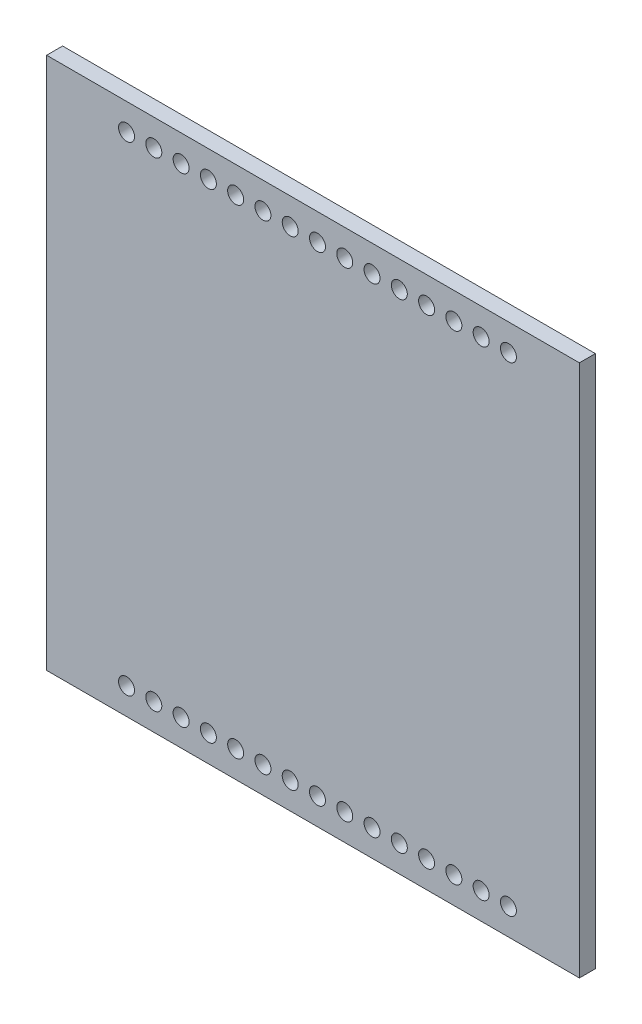
ISO-10303-21;
HEADER;
FILE_DESCRIPTION(('STEP AP214'),'2;1');
FILE_NAME('part.step','',(''),(''),'','','');
FILE_SCHEMA(('AUTOMOTIVE_DESIGN { 1 0 10303 214 1 1 1 1 }'));
ENDSEC;
DATA;
#1=APPLICATION_CONTEXT('core data for automotive mechanical design processes');
#2=APPLICATION_PROTOCOL_DEFINITION('international standard','automotive_design',2000,#1);
#3=PRODUCT_CONTEXT('',#1,'mechanical');
#4=PRODUCT('Part','Part','',(#3));
#5=PRODUCT_RELATED_PRODUCT_CATEGORY('part','',(#4));
#6=PRODUCT_DEFINITION_FORMATION('','',#4);
#7=PRODUCT_DEFINITION_CONTEXT('part definition',#1,'design');
#8=PRODUCT_DEFINITION('design','',#6,#7);
#9=PRODUCT_DEFINITION_SHAPE('','',#8);
#10=(LENGTH_UNIT() NAMED_UNIT(*) SI_UNIT(.MILLI.,.METRE.));
#11=(NAMED_UNIT(*) PLANE_ANGLE_UNIT() SI_UNIT($,.RADIAN.));
#12=(NAMED_UNIT(*) SI_UNIT($,.STERADIAN.) SOLID_ANGLE_UNIT());
#13=UNCERTAINTY_MEASURE_WITH_UNIT(LENGTH_MEASURE(1.E-05),#10,'distance_accuracy_value','');
#14=(GEOMETRIC_REPRESENTATION_CONTEXT(3) GLOBAL_UNCERTAINTY_ASSIGNED_CONTEXT((#13)) GLOBAL_UNIT_ASSIGNED_CONTEXT((#10,
#11,#12)) REPRESENTATION_CONTEXT('',''));
#15=CARTESIAN_POINT('',(0.,0.,0.));
#16=DIRECTION('',(0.,0.,1.));
#17=DIRECTION('',(1.,0.,0.));
#18=AXIS2_PLACEMENT_3D('',#15,#16,#17);
#19=CARTESIAN_POINT('',(-25.,-25.,1.5));
#20=DIRECTION('',(1.,0.,0.));
#21=DIRECTION('',(0.,0.,-1.));
#22=AXIS2_PLACEMENT_3D('',#19,#20,#21);
#23=PLANE('',#22);
#24=DIRECTION('',(0.,-1.,0.));
#25=VECTOR('',#24,1.);
#26=CARTESIAN_POINT('',(-25.,-25.,0.));
#27=LINE('',#26,#25);
#28=CARTESIAN_POINT('',(-25.,25.,0.));
#29=VERTEX_POINT('',#28);
#30=CARTESIAN_POINT('',(-25.,-25.,0.));
#31=VERTEX_POINT('',#30);
#32=EDGE_CURVE('E98',#29,#31,#27,.T.);
#33=ORIENTED_EDGE('',*,*,#32,.T.);
#34=DIRECTION('',(0.,0.,-1.));
#35=VECTOR('',#34,1.);
#36=CARTESIAN_POINT('',(-25.,-25.,1.5));
#37=LINE('',#36,#35);
#38=CARTESIAN_POINT('',(-25.,-25.,1.5));
#39=VERTEX_POINT('',#38);
#40=EDGE_CURVE('E11',#39,#31,#37,.T.);
#41=ORIENTED_EDGE('',*,*,#40,.F.);
#42=DIRECTION('',(0.,-1.,0.));
#43=VECTOR('',#42,1.);
#44=CARTESIAN_POINT('',(-25.,-25.,1.5));
#45=LINE('',#44,#43);
#46=CARTESIAN_POINT('',(-25.,25.,1.5));
#47=VERTEX_POINT('',#46);
#48=EDGE_CURVE('E86',#47,#39,#45,.T.);
#49=ORIENTED_EDGE('',*,*,#48,.F.);
#50=DIRECTION('',(0.,0.,-1.));
#51=VECTOR('',#50,1.);
#52=CARTESIAN_POINT('',(-25.,25.,1.5));
#53=LINE('',#52,#51);
#54=EDGE_CURVE('E94',#47,#29,#53,.T.);
#55=ORIENTED_EDGE('',*,*,#54,.T.);
#56=EDGE_LOOP('',(#33,#41,#49,#55));
#57=FACE_BOUND('',#56,.T.);
#58=ADVANCED_FACE('F35',(#57),#23,.F.);
#59=CARTESIAN_POINT('',(25.,-25.,1.5));
#60=DIRECTION('',(0.,1.,0.));
#61=DIRECTION('',(-1.,0.,0.));
#62=AXIS2_PLACEMENT_3D('',#59,#60,#61);
#63=PLANE('',#62);
#64=DIRECTION('',(1.,0.,0.));
#65=VECTOR('',#64,1.);
#66=CARTESIAN_POINT('',(25.,-25.,0.));
#67=LINE('',#66,#65);
#68=CARTESIAN_POINT('',(25.,-25.,0.));
#69=VERTEX_POINT('',#68);
#70=EDGE_CURVE('E90',#31,#69,#67,.T.);
#71=ORIENTED_EDGE('',*,*,#70,.T.);
#72=DIRECTION('',(0.,0.,-1.));
#73=VECTOR('',#72,1.);
#74=CARTESIAN_POINT('',(25.,-25.,1.5));
#75=LINE('',#74,#73);
#76=CARTESIAN_POINT('',(25.,-25.,1.5));
#77=VERTEX_POINT('',#76);
#78=EDGE_CURVE('E43',#77,#69,#75,.T.);
#79=ORIENTED_EDGE('',*,*,#78,.F.);
#80=DIRECTION('',(1.,0.,0.));
#81=VECTOR('',#80,1.);
#82=CARTESIAN_POINT('',(25.,-25.,1.5));
#83=LINE('',#82,#81);
#84=EDGE_CURVE('E81',#39,#77,#83,.T.);
#85=ORIENTED_EDGE('',*,*,#84,.F.);
#86=ORIENTED_EDGE('',*,*,#40,.T.);
#87=EDGE_LOOP('',(#71,#79,#85,#86));
#88=FACE_BOUND('',#87,.T.);
#89=ADVANCED_FACE('F89',(#88),#63,.F.);
#90=CARTESIAN_POINT('',(25.,-25.,1.5));
#91=DIRECTION('',(-1.,0.,0.));
#92=DIRECTION('',(0.,0.,1.));
#93=AXIS2_PLACEMENT_3D('',#90,#91,#92);
#94=PLANE('',#93);
#95=DIRECTION('',(0.,1.,0.));
#96=VECTOR('',#95,1.);
#97=CARTESIAN_POINT('',(25.,-25.,0.));
#98=LINE('',#97,#96);
#99=CARTESIAN_POINT('',(25.,25.,0.));
#100=VERTEX_POINT('',#99);
#101=EDGE_CURVE('E68',#69,#100,#98,.T.);
#102=ORIENTED_EDGE('',*,*,#101,.T.);
#103=DIRECTION('',(0.,0.,-1.));
#104=VECTOR('',#103,1.);
#105=CARTESIAN_POINT('',(25.,25.,1.5));
#106=LINE('',#105,#104);
#107=CARTESIAN_POINT('',(25.,25.,1.5));
#108=VERTEX_POINT('',#107);
#109=EDGE_CURVE('E91',#108,#100,#106,.T.);
#110=ORIENTED_EDGE('',*,*,#109,.F.);
#111=DIRECTION('',(0.,1.,0.));
#112=VECTOR('',#111,1.);
#113=CARTESIAN_POINT('',(25.,-25.,1.5));
#114=LINE('',#113,#112);
#115=EDGE_CURVE('E84',#77,#108,#114,.T.);
#116=ORIENTED_EDGE('',*,*,#115,.F.);
#117=ORIENTED_EDGE('',*,*,#78,.T.);
#118=EDGE_LOOP('',(#102,#110,#116,#117));
#119=FACE_BOUND('',#118,.T.);
#120=ADVANCED_FACE('F92',(#119),#94,.F.);
#121=CARTESIAN_POINT('',(25.,25.,1.5));
#122=DIRECTION('',(0.,-1.,0.));
#123=DIRECTION('',(1.,0.,0.));
#124=AXIS2_PLACEMENT_3D('',#121,#122,#123);
#125=PLANE('',#124);
#126=DIRECTION('',(-1.,0.,0.));
#127=VECTOR('',#126,1.);
#128=CARTESIAN_POINT('',(25.,25.,0.));
#129=LINE('',#128,#127);
#130=EDGE_CURVE('E74',#100,#29,#129,.T.);
#131=ORIENTED_EDGE('',*,*,#130,.T.);
#132=ORIENTED_EDGE('',*,*,#54,.F.);
#133=DIRECTION('',(-1.,0.,0.));
#134=VECTOR('',#133,1.);
#135=CARTESIAN_POINT('',(25.,25.,1.5));
#136=LINE('',#135,#134);
#137=EDGE_CURVE('E51',#108,#47,#136,.T.);
#138=ORIENTED_EDGE('',*,*,#137,.F.);
#139=ORIENTED_EDGE('',*,*,#109,.T.);
#140=EDGE_LOOP('',(#131,#132,#138,#139));
#141=FACE_BOUND('',#140,.T.);
#142=ADVANCED_FACE('F106',(#141),#125,.F.);
#143=CARTESIAN_POINT('',(0.,0.,1.5));
#144=DIRECTION('',(0.,0.,1.));
#145=DIRECTION('',(1.,0.,0.));
#146=AXIS2_PLACEMENT_3D('',#143,#144,#145);
#147=PLANE('',#146);
#148=CARTESIAN_POINT('',(-14.94,-22.5,1.5));
#149=DIRECTION('',(0.,0.,1.));
#150=DIRECTION('',(1.,0.,0.));
#151=AXIS2_PLACEMENT_3D('',#148,#149,#150);
#152=CIRCLE('',#151,0.75);
#153=CARTESIAN_POINT('',(-14.19,-22.5,1.5));
#154=VERTEX_POINT('',#153);
#155=EDGE_CURVE('E286',#154,#154,#152,.T.);
#156=ORIENTED_EDGE('',*,*,#155,.F.);
#157=EDGE_LOOP('',(#156));
#158=FACE_BOUND('',#157,.T.);
#159=CARTESIAN_POINT('',(-12.38,-22.5,1.5));
#160=DIRECTION('',(0.,0.,1.));
#161=DIRECTION('',(1.,0.,0.));
#162=AXIS2_PLACEMENT_3D('',#159,#160,#161);
#163=CIRCLE('',#162,0.75);
#164=CARTESIAN_POINT('',(-11.63,-22.5,1.5));
#165=VERTEX_POINT('',#164);
#166=EDGE_CURVE('E280',#165,#165,#163,.T.);
#167=ORIENTED_EDGE('',*,*,#166,.F.);
#168=EDGE_LOOP('',(#167));
#169=FACE_BOUND('',#168,.T.);
#170=CARTESIAN_POINT('',(-9.81999999999999,-22.5,1.5));
#171=DIRECTION('',(0.,0.,1.));
#172=DIRECTION('',(1.,0.,0.));
#173=AXIS2_PLACEMENT_3D('',#170,#171,#172);
#174=CIRCLE('',#173,0.75);
#175=CARTESIAN_POINT('',(-9.06999999999999,-22.5,1.5));
#176=VERTEX_POINT('',#175);
#177=EDGE_CURVE('E274',#176,#176,#174,.T.);
#178=ORIENTED_EDGE('',*,*,#177,.F.);
#179=EDGE_LOOP('',(#178));
#180=FACE_BOUND('',#179,.T.);
#181=CARTESIAN_POINT('',(-7.25999999999999,-22.5,1.5));
#182=DIRECTION('',(0.,0.,1.));
#183=DIRECTION('',(1.,0.,0.));
#184=AXIS2_PLACEMENT_3D('',#181,#182,#183);
#185=CIRCLE('',#184,0.75);
#186=CARTESIAN_POINT('',(-6.50999999999999,-22.5,1.5));
#187=VERTEX_POINT('',#186);
#188=EDGE_CURVE('E268',#187,#187,#185,.T.);
#189=ORIENTED_EDGE('',*,*,#188,.F.);
#190=EDGE_LOOP('',(#189));
#191=FACE_BOUND('',#190,.T.);
#192=CARTESIAN_POINT('',(-4.69999999999999,-22.5,1.5));
#193=DIRECTION('',(0.,0.,1.));
#194=DIRECTION('',(1.,0.,0.));
#195=AXIS2_PLACEMENT_3D('',#192,#193,#194);
#196=CIRCLE('',#195,0.75);
#197=CARTESIAN_POINT('',(-3.94999999999999,-22.5,1.5));
#198=VERTEX_POINT('',#197);
#199=EDGE_CURVE('E262',#198,#198,#196,.T.);
#200=ORIENTED_EDGE('',*,*,#199,.F.);
#201=EDGE_LOOP('',(#200));
#202=FACE_BOUND('',#201,.T.);
#203=CARTESIAN_POINT('',(-2.13999999999999,-22.5,1.5));
#204=DIRECTION('',(0.,0.,1.));
#205=DIRECTION('',(1.,0.,0.));
#206=AXIS2_PLACEMENT_3D('',#203,#204,#205);
#207=CIRCLE('',#206,0.75);
#208=CARTESIAN_POINT('',(-1.38999999999999,-22.5,1.5));
#209=VERTEX_POINT('',#208);
#210=EDGE_CURVE('E256',#209,#209,#207,.T.);
#211=ORIENTED_EDGE('',*,*,#210,.F.);
#212=EDGE_LOOP('',(#211));
#213=FACE_BOUND('',#212,.T.);
#214=CARTESIAN_POINT('',(0.420000000000007,-22.5,1.5));
#215=DIRECTION('',(0.,0.,1.));
#216=DIRECTION('',(1.,0.,0.));
#217=AXIS2_PLACEMENT_3D('',#214,#215,#216);
#218=CIRCLE('',#217,0.75);
#219=CARTESIAN_POINT('',(1.17000000000001,-22.5,1.5));
#220=VERTEX_POINT('',#219);
#221=EDGE_CURVE('E250',#220,#220,#218,.T.);
#222=ORIENTED_EDGE('',*,*,#221,.F.);
#223=EDGE_LOOP('',(#222));
#224=FACE_BOUND('',#223,.T.);
#225=CARTESIAN_POINT('',(2.98000000000001,-22.5,1.5));
#226=DIRECTION('',(0.,0.,1.));
#227=DIRECTION('',(1.,0.,0.));
#228=AXIS2_PLACEMENT_3D('',#225,#226,#227);
#229=CIRCLE('',#228,0.75);
#230=CARTESIAN_POINT('',(3.73000000000001,-22.5,1.5));
#231=VERTEX_POINT('',#230);
#232=EDGE_CURVE('E244',#231,#231,#229,.T.);
#233=ORIENTED_EDGE('',*,*,#232,.F.);
#234=EDGE_LOOP('',(#233));
#235=FACE_BOUND('',#234,.T.);
#236=CARTESIAN_POINT('',(5.54000000000001,-22.5,1.5));
#237=DIRECTION('',(0.,0.,1.));
#238=DIRECTION('',(1.,0.,0.));
#239=AXIS2_PLACEMENT_3D('',#236,#237,#238);
#240=CIRCLE('',#239,0.75);
#241=CARTESIAN_POINT('',(6.29000000000001,-22.5,1.5));
#242=VERTEX_POINT('',#241);
#243=EDGE_CURVE('E238',#242,#242,#240,.T.);
#244=ORIENTED_EDGE('',*,*,#243,.F.);
#245=EDGE_LOOP('',(#244));
#246=FACE_BOUND('',#245,.T.);
#247=CARTESIAN_POINT('',(8.10000000000001,-22.5,1.5));
#248=DIRECTION('',(0.,0.,1.));
#249=DIRECTION('',(1.,0.,0.));
#250=AXIS2_PLACEMENT_3D('',#247,#248,#249);
#251=CIRCLE('',#250,0.75);
#252=CARTESIAN_POINT('',(8.85000000000001,-22.5,1.5));
#253=VERTEX_POINT('',#252);
#254=EDGE_CURVE('E232',#253,#253,#251,.T.);
#255=ORIENTED_EDGE('',*,*,#254,.F.);
#256=EDGE_LOOP('',(#255));
#257=FACE_BOUND('',#256,.T.);
#258=CARTESIAN_POINT('',(10.66,-22.5,1.5));
#259=DIRECTION('',(0.,0.,1.));
#260=DIRECTION('',(1.,0.,0.));
#261=AXIS2_PLACEMENT_3D('',#258,#259,#260);
#262=CIRCLE('',#261,0.75);
#263=CARTESIAN_POINT('',(11.41,-22.5,1.5));
#264=VERTEX_POINT('',#263);
#265=EDGE_CURVE('E226',#264,#264,#262,.T.);
#266=ORIENTED_EDGE('',*,*,#265,.F.);
#267=EDGE_LOOP('',(#266));
#268=FACE_BOUND('',#267,.T.);
#269=CARTESIAN_POINT('',(13.22,-22.5,1.5));
#270=DIRECTION('',(0.,0.,1.));
#271=DIRECTION('',(1.,0.,0.));
#272=AXIS2_PLACEMENT_3D('',#269,#270,#271);
#273=CIRCLE('',#272,0.75);
#274=CARTESIAN_POINT('',(13.97,-22.5,1.5));
#275=VERTEX_POINT('',#274);
#276=EDGE_CURVE('E220',#275,#275,#273,.T.);
#277=ORIENTED_EDGE('',*,*,#276,.F.);
#278=EDGE_LOOP('',(#277));
#279=FACE_BOUND('',#278,.T.);
#280=CARTESIAN_POINT('',(15.78,-22.5,1.5));
#281=DIRECTION('',(0.,0.,1.));
#282=DIRECTION('',(1.,0.,0.));
#283=AXIS2_PLACEMENT_3D('',#280,#281,#282);
#284=CIRCLE('',#283,0.750000000000002);
#285=CARTESIAN_POINT('',(16.53,-22.5,1.5));
#286=VERTEX_POINT('',#285);
#287=EDGE_CURVE('E214',#286,#286,#284,.T.);
#288=ORIENTED_EDGE('',*,*,#287,.F.);
#289=EDGE_LOOP('',(#288));
#290=FACE_BOUND('',#289,.T.);
#291=CARTESIAN_POINT('',(18.34,-22.5,1.5));
#292=DIRECTION('',(0.,0.,1.));
#293=DIRECTION('',(1.,0.,0.));
#294=AXIS2_PLACEMENT_3D('',#291,#292,#293);
#295=CIRCLE('',#294,0.750000000000002);
#296=CARTESIAN_POINT('',(19.09,-22.5,1.5));
#297=VERTEX_POINT('',#296);
#298=EDGE_CURVE('E208',#297,#297,#295,.T.);
#299=ORIENTED_EDGE('',*,*,#298,.F.);
#300=EDGE_LOOP('',(#299));
#301=FACE_BOUND('',#300,.T.);
#302=CARTESIAN_POINT('',(18.34,22.5,1.5));
#303=DIRECTION('',(0.,0.,1.));
#304=DIRECTION('',(-1.,0.,0.));
#305=AXIS2_PLACEMENT_3D('',#302,#303,#304);
#306=CIRCLE('',#305,0.750000000000002);
#307=CARTESIAN_POINT('',(17.59,22.5,1.5));
#308=VERTEX_POINT('',#307);
#309=EDGE_CURVE('E202',#308,#308,#306,.T.);
#310=ORIENTED_EDGE('',*,*,#309,.F.);
#311=EDGE_LOOP('',(#310));
#312=FACE_BOUND('',#311,.T.);
#313=CARTESIAN_POINT('',(15.78,22.5,1.5));
#314=DIRECTION('',(0.,0.,1.));
#315=DIRECTION('',(-1.,0.,0.));
#316=AXIS2_PLACEMENT_3D('',#313,#314,#315);
#317=CIRCLE('',#316,0.750000000000002);
#318=CARTESIAN_POINT('',(15.03,22.5,1.5));
#319=VERTEX_POINT('',#318);
#320=EDGE_CURVE('E196',#319,#319,#317,.T.);
#321=ORIENTED_EDGE('',*,*,#320,.F.);
#322=EDGE_LOOP('',(#321));
#323=FACE_BOUND('',#322,.T.);
#324=CARTESIAN_POINT('',(13.22,22.5,1.5));
#325=DIRECTION('',(0.,0.,1.));
#326=DIRECTION('',(-1.,0.,0.));
#327=AXIS2_PLACEMENT_3D('',#324,#325,#326);
#328=CIRCLE('',#327,0.75);
#329=CARTESIAN_POINT('',(12.47,22.5,1.5));
#330=VERTEX_POINT('',#329);
#331=EDGE_CURVE('E190',#330,#330,#328,.T.);
#332=ORIENTED_EDGE('',*,*,#331,.F.);
#333=EDGE_LOOP('',(#332));
#334=FACE_BOUND('',#333,.T.);
#335=CARTESIAN_POINT('',(10.66,22.5,1.5));
#336=DIRECTION('',(0.,0.,1.));
#337=DIRECTION('',(-1.,0.,0.));
#338=AXIS2_PLACEMENT_3D('',#335,#336,#337);
#339=CIRCLE('',#338,0.75);
#340=CARTESIAN_POINT('',(9.91000000000001,22.5,1.5));
#341=VERTEX_POINT('',#340);
#342=EDGE_CURVE('E184',#341,#341,#339,.T.);
#343=ORIENTED_EDGE('',*,*,#342,.F.);
#344=EDGE_LOOP('',(#343));
#345=FACE_BOUND('',#344,.T.);
#346=CARTESIAN_POINT('',(8.10000000000001,22.5,1.5));
#347=DIRECTION('',(0.,0.,1.));
#348=DIRECTION('',(-1.,0.,0.));
#349=AXIS2_PLACEMENT_3D('',#346,#347,#348);
#350=CIRCLE('',#349,0.75);
#351=CARTESIAN_POINT('',(7.35000000000001,22.5,1.5));
#352=VERTEX_POINT('',#351);
#353=EDGE_CURVE('E178',#352,#352,#350,.T.);
#354=ORIENTED_EDGE('',*,*,#353,.F.);
#355=EDGE_LOOP('',(#354));
#356=FACE_BOUND('',#355,.T.);
#357=CARTESIAN_POINT('',(5.54000000000001,22.5,1.5));
#358=DIRECTION('',(0.,0.,1.));
#359=DIRECTION('',(-1.,0.,0.));
#360=AXIS2_PLACEMENT_3D('',#357,#358,#359);
#361=CIRCLE('',#360,0.75);
#362=CARTESIAN_POINT('',(4.79000000000001,22.5,1.5));
#363=VERTEX_POINT('',#362);
#364=EDGE_CURVE('E172',#363,#363,#361,.T.);
#365=ORIENTED_EDGE('',*,*,#364,.F.);
#366=EDGE_LOOP('',(#365));
#367=FACE_BOUND('',#366,.T.);
#368=CARTESIAN_POINT('',(2.98000000000001,22.5,1.5));
#369=DIRECTION('',(0.,0.,1.));
#370=DIRECTION('',(-1.,0.,0.));
#371=AXIS2_PLACEMENT_3D('',#368,#369,#370);
#372=CIRCLE('',#371,0.75);
#373=CARTESIAN_POINT('',(2.23000000000001,22.5,1.5));
#374=VERTEX_POINT('',#373);
#375=EDGE_CURVE('E166',#374,#374,#372,.T.);
#376=ORIENTED_EDGE('',*,*,#375,.F.);
#377=EDGE_LOOP('',(#376));
#378=FACE_BOUND('',#377,.T.);
#379=CARTESIAN_POINT('',(0.420000000000007,22.5,1.5));
#380=DIRECTION('',(0.,0.,1.));
#381=DIRECTION('',(-1.,0.,0.));
#382=AXIS2_PLACEMENT_3D('',#379,#380,#381);
#383=CIRCLE('',#382,0.75);
#384=CARTESIAN_POINT('',(-0.329999999999993,22.5,1.5));
#385=VERTEX_POINT('',#384);
#386=EDGE_CURVE('E160',#385,#385,#383,.T.);
#387=ORIENTED_EDGE('',*,*,#386,.F.);
#388=EDGE_LOOP('',(#387));
#389=FACE_BOUND('',#388,.T.);
#390=CARTESIAN_POINT('',(-2.13999999999999,22.5,1.5));
#391=DIRECTION('',(0.,0.,1.));
#392=DIRECTION('',(-1.,0.,0.));
#393=AXIS2_PLACEMENT_3D('',#390,#391,#392);
#394=CIRCLE('',#393,0.75);
#395=CARTESIAN_POINT('',(-2.88999999999999,22.5,1.5));
#396=VERTEX_POINT('',#395);
#397=EDGE_CURVE('E154',#396,#396,#394,.T.);
#398=ORIENTED_EDGE('',*,*,#397,.F.);
#399=EDGE_LOOP('',(#398));
#400=FACE_BOUND('',#399,.T.);
#401=CARTESIAN_POINT('',(-4.69999999999999,22.5,1.5));
#402=DIRECTION('',(0.,0.,1.));
#403=DIRECTION('',(-1.,0.,0.));
#404=AXIS2_PLACEMENT_3D('',#401,#402,#403);
#405=CIRCLE('',#404,0.75);
#406=CARTESIAN_POINT('',(-5.44999999999999,22.5,1.5));
#407=VERTEX_POINT('',#406);
#408=EDGE_CURVE('E148',#407,#407,#405,.T.);
#409=ORIENTED_EDGE('',*,*,#408,.F.);
#410=EDGE_LOOP('',(#409));
#411=FACE_BOUND('',#410,.T.);
#412=CARTESIAN_POINT('',(-7.25999999999999,22.5,1.5));
#413=DIRECTION('',(0.,0.,1.));
#414=DIRECTION('',(-1.,0.,0.));
#415=AXIS2_PLACEMENT_3D('',#412,#413,#414);
#416=CIRCLE('',#415,0.75);
#417=CARTESIAN_POINT('',(-8.00999999999999,22.5,1.5));
#418=VERTEX_POINT('',#417);
#419=EDGE_CURVE('E142',#418,#418,#416,.T.);
#420=ORIENTED_EDGE('',*,*,#419,.F.);
#421=EDGE_LOOP('',(#420));
#422=FACE_BOUND('',#421,.T.);
#423=CARTESIAN_POINT('',(-9.81999999999999,22.5,1.5));
#424=DIRECTION('',(0.,0.,1.));
#425=DIRECTION('',(-1.,0.,0.));
#426=AXIS2_PLACEMENT_3D('',#423,#424,#425);
#427=CIRCLE('',#426,0.75);
#428=CARTESIAN_POINT('',(-10.57,22.5,1.5));
#429=VERTEX_POINT('',#428);
#430=EDGE_CURVE('E136',#429,#429,#427,.T.);
#431=ORIENTED_EDGE('',*,*,#430,.F.);
#432=EDGE_LOOP('',(#431));
#433=FACE_BOUND('',#432,.T.);
#434=CARTESIAN_POINT('',(-12.38,22.5,1.5));
#435=DIRECTION('',(0.,0.,1.));
#436=DIRECTION('',(-1.,0.,0.));
#437=AXIS2_PLACEMENT_3D('',#434,#435,#436);
#438=CIRCLE('',#437,0.75);
#439=CARTESIAN_POINT('',(-13.13,22.5,1.5));
#440=VERTEX_POINT('',#439);
#441=EDGE_CURVE('E130',#440,#440,#438,.T.);
#442=ORIENTED_EDGE('',*,*,#441,.F.);
#443=EDGE_LOOP('',(#442));
#444=FACE_BOUND('',#443,.T.);
#445=CARTESIAN_POINT('',(-14.94,22.5,1.5));
#446=DIRECTION('',(0.,0.,1.));
#447=DIRECTION('',(-1.,0.,0.));
#448=AXIS2_PLACEMENT_3D('',#445,#446,#447);
#449=CIRCLE('',#448,0.75);
#450=CARTESIAN_POINT('',(-15.69,22.5,1.5));
#451=VERTEX_POINT('',#450);
#452=EDGE_CURVE('E124',#451,#451,#449,.T.);
#453=ORIENTED_EDGE('',*,*,#452,.F.);
#454=EDGE_LOOP('',(#453));
#455=FACE_BOUND('',#454,.T.);
#456=CARTESIAN_POINT('',(-17.5,22.5,1.5));
#457=DIRECTION('',(0.,0.,1.));
#458=DIRECTION('',(-1.,0.,0.));
#459=AXIS2_PLACEMENT_3D('',#456,#457,#458);
#460=CIRCLE('',#459,0.750000000000002);
#461=CARTESIAN_POINT('',(-18.25,22.5,1.5));
#462=VERTEX_POINT('',#461);
#463=EDGE_CURVE('E118',#462,#462,#460,.T.);
#464=ORIENTED_EDGE('',*,*,#463,.F.);
#465=EDGE_LOOP('',(#464));
#466=FACE_BOUND('',#465,.T.);
#467=CARTESIAN_POINT('',(-17.5,-22.5,1.5));
#468=DIRECTION('',(0.,0.,1.));
#469=DIRECTION('',(1.,0.,0.));
#470=AXIS2_PLACEMENT_3D('',#467,#468,#469);
#471=CIRCLE('',#470,0.750000000000002);
#472=CARTESIAN_POINT('',(-16.75,-22.5,1.5));
#473=VERTEX_POINT('',#472);
#474=EDGE_CURVE('E112',#473,#473,#471,.T.);
#475=ORIENTED_EDGE('',*,*,#474,.F.);
#476=EDGE_LOOP('',(#475));
#477=FACE_BOUND('',#476,.T.);
#478=ORIENTED_EDGE('',*,*,#48,.T.);
#479=ORIENTED_EDGE('',*,*,#84,.T.);
#480=ORIENTED_EDGE('',*,*,#115,.T.);
#481=ORIENTED_EDGE('',*,*,#137,.T.);
#482=EDGE_LOOP('',(#478,#479,#480,#481));
#483=FACE_BOUND('',#482,.T.);
#484=ADVANCED_FACE('F82',(#158,#169,#180,#191,#202,#213,#224,#235,#246,#257,#268,#279,#290,#301,
#312,#323,#334,#345,#356,#367,#378,#389,#400,#411,#422,#433,#444,#455,#466,#477,#483),#147,.T.);
#485=CARTESIAN_POINT('',(0.,0.,0.));
#486=DIRECTION('',(0.,0.,1.));
#487=DIRECTION('',(1.,0.,0.));
#488=AXIS2_PLACEMENT_3D('',#485,#486,#487);
#489=PLANE('',#488);
#490=CARTESIAN_POINT('',(-14.94,-22.5,0.));
#491=DIRECTION('',(0.,0.,1.));
#492=DIRECTION('',(1.,0.,0.));
#493=AXIS2_PLACEMENT_3D('',#490,#491,#492);
#494=CIRCLE('',#493,0.75);
#495=CARTESIAN_POINT('',(-14.19,-22.5,0.));
#496=VERTEX_POINT('',#495);
#497=EDGE_CURVE('E115',#496,#496,#494,.T.);
#498=ORIENTED_EDGE('',*,*,#497,.T.);
#499=EDGE_LOOP('',(#498));
#500=FACE_BOUND('',#499,.T.);
#501=CARTESIAN_POINT('',(-12.38,-22.5,0.));
#502=DIRECTION('',(0.,0.,1.));
#503=DIRECTION('',(1.,0.,0.));
#504=AXIS2_PLACEMENT_3D('',#501,#502,#503);
#505=CIRCLE('',#504,0.75);
#506=CARTESIAN_POINT('',(-11.63,-22.5,0.));
#507=VERTEX_POINT('',#506);
#508=EDGE_CURVE('E283',#507,#507,#505,.T.);
#509=ORIENTED_EDGE('',*,*,#508,.T.);
#510=EDGE_LOOP('',(#509));
#511=FACE_BOUND('',#510,.T.);
#512=CARTESIAN_POINT('',(-9.81999999999999,-22.5,0.));
#513=DIRECTION('',(0.,0.,1.));
#514=DIRECTION('',(1.,0.,0.));
#515=AXIS2_PLACEMENT_3D('',#512,#513,#514);
#516=CIRCLE('',#515,0.75);
#517=CARTESIAN_POINT('',(-9.06999999999999,-22.5,0.));
#518=VERTEX_POINT('',#517);
#519=EDGE_CURVE('E277',#518,#518,#516,.T.);
#520=ORIENTED_EDGE('',*,*,#519,.T.);
#521=EDGE_LOOP('',(#520));
#522=FACE_BOUND('',#521,.T.);
#523=CARTESIAN_POINT('',(-7.25999999999999,-22.5,0.));
#524=DIRECTION('',(0.,0.,1.));
#525=DIRECTION('',(1.,0.,0.));
#526=AXIS2_PLACEMENT_3D('',#523,#524,#525);
#527=CIRCLE('',#526,0.75);
#528=CARTESIAN_POINT('',(-6.50999999999999,-22.5,0.));
#529=VERTEX_POINT('',#528);
#530=EDGE_CURVE('E271',#529,#529,#527,.T.);
#531=ORIENTED_EDGE('',*,*,#530,.T.);
#532=EDGE_LOOP('',(#531));
#533=FACE_BOUND('',#532,.T.);
#534=CARTESIAN_POINT('',(-4.69999999999999,-22.5,0.));
#535=DIRECTION('',(0.,0.,1.));
#536=DIRECTION('',(1.,0.,0.));
#537=AXIS2_PLACEMENT_3D('',#534,#535,#536);
#538=CIRCLE('',#537,0.75);
#539=CARTESIAN_POINT('',(-3.94999999999999,-22.5,0.));
#540=VERTEX_POINT('',#539);
#541=EDGE_CURVE('E265',#540,#540,#538,.T.);
#542=ORIENTED_EDGE('',*,*,#541,.T.);
#543=EDGE_LOOP('',(#542));
#544=FACE_BOUND('',#543,.T.);
#545=CARTESIAN_POINT('',(-2.13999999999999,-22.5,0.));
#546=DIRECTION('',(0.,0.,1.));
#547=DIRECTION('',(1.,0.,0.));
#548=AXIS2_PLACEMENT_3D('',#545,#546,#547);
#549=CIRCLE('',#548,0.75);
#550=CARTESIAN_POINT('',(-1.38999999999999,-22.5,0.));
#551=VERTEX_POINT('',#550);
#552=EDGE_CURVE('E259',#551,#551,#549,.T.);
#553=ORIENTED_EDGE('',*,*,#552,.T.);
#554=EDGE_LOOP('',(#553));
#555=FACE_BOUND('',#554,.T.);
#556=CARTESIAN_POINT('',(0.420000000000007,-22.5,0.));
#557=DIRECTION('',(0.,0.,1.));
#558=DIRECTION('',(1.,0.,0.));
#559=AXIS2_PLACEMENT_3D('',#556,#557,#558);
#560=CIRCLE('',#559,0.75);
#561=CARTESIAN_POINT('',(1.17000000000001,-22.5,0.));
#562=VERTEX_POINT('',#561);
#563=EDGE_CURVE('E253',#562,#562,#560,.T.);
#564=ORIENTED_EDGE('',*,*,#563,.T.);
#565=EDGE_LOOP('',(#564));
#566=FACE_BOUND('',#565,.T.);
#567=CARTESIAN_POINT('',(2.98000000000001,-22.5,0.));
#568=DIRECTION('',(0.,0.,1.));
#569=DIRECTION('',(1.,0.,0.));
#570=AXIS2_PLACEMENT_3D('',#567,#568,#569);
#571=CIRCLE('',#570,0.75);
#572=CARTESIAN_POINT('',(3.73000000000001,-22.5,0.));
#573=VERTEX_POINT('',#572);
#574=EDGE_CURVE('E247',#573,#573,#571,.T.);
#575=ORIENTED_EDGE('',*,*,#574,.T.);
#576=EDGE_LOOP('',(#575));
#577=FACE_BOUND('',#576,.T.);
#578=CARTESIAN_POINT('',(5.54000000000001,-22.5,0.));
#579=DIRECTION('',(0.,0.,1.));
#580=DIRECTION('',(1.,0.,0.));
#581=AXIS2_PLACEMENT_3D('',#578,#579,#580);
#582=CIRCLE('',#581,0.75);
#583=CARTESIAN_POINT('',(6.29000000000001,-22.5,0.));
#584=VERTEX_POINT('',#583);
#585=EDGE_CURVE('E241',#584,#584,#582,.T.);
#586=ORIENTED_EDGE('',*,*,#585,.T.);
#587=EDGE_LOOP('',(#586));
#588=FACE_BOUND('',#587,.T.);
#589=CARTESIAN_POINT('',(8.10000000000001,-22.5,0.));
#590=DIRECTION('',(0.,0.,1.));
#591=DIRECTION('',(1.,0.,0.));
#592=AXIS2_PLACEMENT_3D('',#589,#590,#591);
#593=CIRCLE('',#592,0.75);
#594=CARTESIAN_POINT('',(8.85000000000001,-22.5,0.));
#595=VERTEX_POINT('',#594);
#596=EDGE_CURVE('E235',#595,#595,#593,.T.);
#597=ORIENTED_EDGE('',*,*,#596,.T.);
#598=EDGE_LOOP('',(#597));
#599=FACE_BOUND('',#598,.T.);
#600=CARTESIAN_POINT('',(10.66,-22.5,0.));
#601=DIRECTION('',(0.,0.,1.));
#602=DIRECTION('',(1.,0.,0.));
#603=AXIS2_PLACEMENT_3D('',#600,#601,#602);
#604=CIRCLE('',#603,0.75);
#605=CARTESIAN_POINT('',(11.41,-22.5,0.));
#606=VERTEX_POINT('',#605);
#607=EDGE_CURVE('E229',#606,#606,#604,.T.);
#608=ORIENTED_EDGE('',*,*,#607,.T.);
#609=EDGE_LOOP('',(#608));
#610=FACE_BOUND('',#609,.T.);
#611=CARTESIAN_POINT('',(13.22,-22.5,0.));
#612=DIRECTION('',(0.,0.,1.));
#613=DIRECTION('',(1.,0.,0.));
#614=AXIS2_PLACEMENT_3D('',#611,#612,#613);
#615=CIRCLE('',#614,0.75);
#616=CARTESIAN_POINT('',(13.97,-22.5,0.));
#617=VERTEX_POINT('',#616);
#618=EDGE_CURVE('E223',#617,#617,#615,.T.);
#619=ORIENTED_EDGE('',*,*,#618,.T.);
#620=EDGE_LOOP('',(#619));
#621=FACE_BOUND('',#620,.T.);
#622=CARTESIAN_POINT('',(15.78,-22.5,0.));
#623=DIRECTION('',(0.,0.,1.));
#624=DIRECTION('',(1.,0.,0.));
#625=AXIS2_PLACEMENT_3D('',#622,#623,#624);
#626=CIRCLE('',#625,0.750000000000002);
#627=CARTESIAN_POINT('',(16.53,-22.5,0.));
#628=VERTEX_POINT('',#627);
#629=EDGE_CURVE('E217',#628,#628,#626,.T.);
#630=ORIENTED_EDGE('',*,*,#629,.T.);
#631=EDGE_LOOP('',(#630));
#632=FACE_BOUND('',#631,.T.);
#633=CARTESIAN_POINT('',(18.34,-22.5,0.));
#634=DIRECTION('',(0.,0.,1.));
#635=DIRECTION('',(1.,0.,0.));
#636=AXIS2_PLACEMENT_3D('',#633,#634,#635);
#637=CIRCLE('',#636,0.750000000000002);
#638=CARTESIAN_POINT('',(19.09,-22.5,0.));
#639=VERTEX_POINT('',#638);
#640=EDGE_CURVE('E211',#639,#639,#637,.T.);
#641=ORIENTED_EDGE('',*,*,#640,.T.);
#642=EDGE_LOOP('',(#641));
#643=FACE_BOUND('',#642,.T.);
#644=CARTESIAN_POINT('',(18.34,22.5,0.));
#645=DIRECTION('',(0.,0.,1.));
#646=DIRECTION('',(-1.,0.,0.));
#647=AXIS2_PLACEMENT_3D('',#644,#645,#646);
#648=CIRCLE('',#647,0.750000000000002);
#649=CARTESIAN_POINT('',(17.59,22.5,0.));
#650=VERTEX_POINT('',#649);
#651=EDGE_CURVE('E205',#650,#650,#648,.T.);
#652=ORIENTED_EDGE('',*,*,#651,.T.);
#653=EDGE_LOOP('',(#652));
#654=FACE_BOUND('',#653,.T.);
#655=CARTESIAN_POINT('',(15.78,22.5,0.));
#656=DIRECTION('',(0.,0.,1.));
#657=DIRECTION('',(-1.,0.,0.));
#658=AXIS2_PLACEMENT_3D('',#655,#656,#657);
#659=CIRCLE('',#658,0.750000000000002);
#660=CARTESIAN_POINT('',(15.03,22.5,0.));
#661=VERTEX_POINT('',#660);
#662=EDGE_CURVE('E199',#661,#661,#659,.T.);
#663=ORIENTED_EDGE('',*,*,#662,.T.);
#664=EDGE_LOOP('',(#663));
#665=FACE_BOUND('',#664,.T.);
#666=CARTESIAN_POINT('',(13.22,22.5,0.));
#667=DIRECTION('',(0.,0.,1.));
#668=DIRECTION('',(-1.,0.,0.));
#669=AXIS2_PLACEMENT_3D('',#666,#667,#668);
#670=CIRCLE('',#669,0.75);
#671=CARTESIAN_POINT('',(12.47,22.5,0.));
#672=VERTEX_POINT('',#671);
#673=EDGE_CURVE('E193',#672,#672,#670,.T.);
#674=ORIENTED_EDGE('',*,*,#673,.T.);
#675=EDGE_LOOP('',(#674));
#676=FACE_BOUND('',#675,.T.);
#677=CARTESIAN_POINT('',(10.66,22.5,0.));
#678=DIRECTION('',(0.,0.,1.));
#679=DIRECTION('',(-1.,0.,0.));
#680=AXIS2_PLACEMENT_3D('',#677,#678,#679);
#681=CIRCLE('',#680,0.75);
#682=CARTESIAN_POINT('',(9.91000000000001,22.5,0.));
#683=VERTEX_POINT('',#682);
#684=EDGE_CURVE('E187',#683,#683,#681,.T.);
#685=ORIENTED_EDGE('',*,*,#684,.T.);
#686=EDGE_LOOP('',(#685));
#687=FACE_BOUND('',#686,.T.);
#688=CARTESIAN_POINT('',(8.10000000000001,22.5,0.));
#689=DIRECTION('',(0.,0.,1.));
#690=DIRECTION('',(-1.,0.,0.));
#691=AXIS2_PLACEMENT_3D('',#688,#689,#690);
#692=CIRCLE('',#691,0.75);
#693=CARTESIAN_POINT('',(7.35000000000001,22.5,0.));
#694=VERTEX_POINT('',#693);
#695=EDGE_CURVE('E181',#694,#694,#692,.T.);
#696=ORIENTED_EDGE('',*,*,#695,.T.);
#697=EDGE_LOOP('',(#696));
#698=FACE_BOUND('',#697,.T.);
#699=CARTESIAN_POINT('',(5.54000000000001,22.5,0.));
#700=DIRECTION('',(0.,0.,1.));
#701=DIRECTION('',(-1.,0.,0.));
#702=AXIS2_PLACEMENT_3D('',#699,#700,#701);
#703=CIRCLE('',#702,0.75);
#704=CARTESIAN_POINT('',(4.79000000000001,22.5,0.));
#705=VERTEX_POINT('',#704);
#706=EDGE_CURVE('E175',#705,#705,#703,.T.);
#707=ORIENTED_EDGE('',*,*,#706,.T.);
#708=EDGE_LOOP('',(#707));
#709=FACE_BOUND('',#708,.T.);
#710=CARTESIAN_POINT('',(2.98000000000001,22.5,0.));
#711=DIRECTION('',(0.,0.,1.));
#712=DIRECTION('',(-1.,0.,0.));
#713=AXIS2_PLACEMENT_3D('',#710,#711,#712);
#714=CIRCLE('',#713,0.75);
#715=CARTESIAN_POINT('',(2.23000000000001,22.5,0.));
#716=VERTEX_POINT('',#715);
#717=EDGE_CURVE('E169',#716,#716,#714,.T.);
#718=ORIENTED_EDGE('',*,*,#717,.T.);
#719=EDGE_LOOP('',(#718));
#720=FACE_BOUND('',#719,.T.);
#721=CARTESIAN_POINT('',(0.420000000000007,22.5,0.));
#722=DIRECTION('',(0.,0.,1.));
#723=DIRECTION('',(-1.,0.,0.));
#724=AXIS2_PLACEMENT_3D('',#721,#722,#723);
#725=CIRCLE('',#724,0.75);
#726=CARTESIAN_POINT('',(-0.329999999999993,22.5,0.));
#727=VERTEX_POINT('',#726);
#728=EDGE_CURVE('E163',#727,#727,#725,.T.);
#729=ORIENTED_EDGE('',*,*,#728,.T.);
#730=EDGE_LOOP('',(#729));
#731=FACE_BOUND('',#730,.T.);
#732=CARTESIAN_POINT('',(-2.13999999999999,22.5,0.));
#733=DIRECTION('',(0.,0.,1.));
#734=DIRECTION('',(-1.,0.,0.));
#735=AXIS2_PLACEMENT_3D('',#732,#733,#734);
#736=CIRCLE('',#735,0.75);
#737=CARTESIAN_POINT('',(-2.88999999999999,22.5,0.));
#738=VERTEX_POINT('',#737);
#739=EDGE_CURVE('E157',#738,#738,#736,.T.);
#740=ORIENTED_EDGE('',*,*,#739,.T.);
#741=EDGE_LOOP('',(#740));
#742=FACE_BOUND('',#741,.T.);
#743=CARTESIAN_POINT('',(-4.69999999999999,22.5,0.));
#744=DIRECTION('',(0.,0.,1.));
#745=DIRECTION('',(-1.,0.,0.));
#746=AXIS2_PLACEMENT_3D('',#743,#744,#745);
#747=CIRCLE('',#746,0.75);
#748=CARTESIAN_POINT('',(-5.44999999999999,22.5,0.));
#749=VERTEX_POINT('',#748);
#750=EDGE_CURVE('E151',#749,#749,#747,.T.);
#751=ORIENTED_EDGE('',*,*,#750,.T.);
#752=EDGE_LOOP('',(#751));
#753=FACE_BOUND('',#752,.T.);
#754=CARTESIAN_POINT('',(-7.25999999999999,22.5,0.));
#755=DIRECTION('',(0.,0.,1.));
#756=DIRECTION('',(-1.,0.,0.));
#757=AXIS2_PLACEMENT_3D('',#754,#755,#756);
#758=CIRCLE('',#757,0.75);
#759=CARTESIAN_POINT('',(-8.00999999999999,22.5,0.));
#760=VERTEX_POINT('',#759);
#761=EDGE_CURVE('E145',#760,#760,#758,.T.);
#762=ORIENTED_EDGE('',*,*,#761,.T.);
#763=EDGE_LOOP('',(#762));
#764=FACE_BOUND('',#763,.T.);
#765=CARTESIAN_POINT('',(-9.81999999999999,22.5,0.));
#766=DIRECTION('',(0.,0.,1.));
#767=DIRECTION('',(-1.,0.,0.));
#768=AXIS2_PLACEMENT_3D('',#765,#766,#767);
#769=CIRCLE('',#768,0.75);
#770=CARTESIAN_POINT('',(-10.57,22.5,0.));
#771=VERTEX_POINT('',#770);
#772=EDGE_CURVE('E139',#771,#771,#769,.T.);
#773=ORIENTED_EDGE('',*,*,#772,.T.);
#774=EDGE_LOOP('',(#773));
#775=FACE_BOUND('',#774,.T.);
#776=CARTESIAN_POINT('',(-12.38,22.5,0.));
#777=DIRECTION('',(0.,0.,1.));
#778=DIRECTION('',(-1.,0.,0.));
#779=AXIS2_PLACEMENT_3D('',#776,#777,#778);
#780=CIRCLE('',#779,0.75);
#781=CARTESIAN_POINT('',(-13.13,22.5,0.));
#782=VERTEX_POINT('',#781);
#783=EDGE_CURVE('E133',#782,#782,#780,.T.);
#784=ORIENTED_EDGE('',*,*,#783,.T.);
#785=EDGE_LOOP('',(#784));
#786=FACE_BOUND('',#785,.T.);
#787=CARTESIAN_POINT('',(-14.94,22.5,0.));
#788=DIRECTION('',(0.,0.,1.));
#789=DIRECTION('',(-1.,0.,0.));
#790=AXIS2_PLACEMENT_3D('',#787,#788,#789);
#791=CIRCLE('',#790,0.75);
#792=CARTESIAN_POINT('',(-15.69,22.5,0.));
#793=VERTEX_POINT('',#792);
#794=EDGE_CURVE('E127',#793,#793,#791,.T.);
#795=ORIENTED_EDGE('',*,*,#794,.T.);
#796=EDGE_LOOP('',(#795));
#797=FACE_BOUND('',#796,.T.);
#798=CARTESIAN_POINT('',(-17.5,22.5,0.));
#799=DIRECTION('',(0.,0.,1.));
#800=DIRECTION('',(-1.,0.,0.));
#801=AXIS2_PLACEMENT_3D('',#798,#799,#800);
#802=CIRCLE('',#801,0.750000000000002);
#803=CARTESIAN_POINT('',(-18.25,22.5,0.));
#804=VERTEX_POINT('',#803);
#805=EDGE_CURVE('E121',#804,#804,#802,.T.);
#806=ORIENTED_EDGE('',*,*,#805,.T.);
#807=EDGE_LOOP('',(#806));
#808=FACE_BOUND('',#807,.T.);
#809=CARTESIAN_POINT('',(-17.5,-22.5,0.));
#810=DIRECTION('',(0.,0.,1.));
#811=DIRECTION('',(1.,0.,0.));
#812=AXIS2_PLACEMENT_3D('',#809,#810,#811);
#813=CIRCLE('',#812,0.750000000000002);
#814=CARTESIAN_POINT('',(-16.75,-22.5,0.));
#815=VERTEX_POINT('',#814);
#816=EDGE_CURVE('E101',#815,#815,#813,.T.);
#817=ORIENTED_EDGE('',*,*,#816,.T.);
#818=EDGE_LOOP('',(#817));
#819=FACE_BOUND('',#818,.T.);
#820=ORIENTED_EDGE('',*,*,#32,.F.);
#821=ORIENTED_EDGE('',*,*,#130,.F.);
#822=ORIENTED_EDGE('',*,*,#101,.F.);
#823=ORIENTED_EDGE('',*,*,#70,.F.);
#824=EDGE_LOOP('',(#820,#821,#822,#823));
#825=FACE_BOUND('',#824,.T.);
#826=ADVANCED_FACE('F109',(#500,#511,#522,#533,#544,#555,#566,#577,#588,#599,#610,#621,#632,
#643,#654,#665,#676,#687,#698,#709,#720,#731,#742,#753,#764,#775,#786,#797,#808,#819,#825),#489,.F.);
#827=CARTESIAN_POINT('',(-17.5,-22.5,0.));
#828=DIRECTION('',(0.,0.,1.));
#829=DIRECTION('',(1.,0.,0.));
#830=AXIS2_PLACEMENT_3D('',#827,#828,#829);
#831=CYLINDRICAL_SURFACE('',#830,0.750000000000002);
#832=ORIENTED_EDGE('',*,*,#816,.F.);
#833=EDGE_LOOP('',(#832));
#834=FACE_BOUND('',#833,.T.);
#835=ORIENTED_EDGE('',*,*,#474,.T.);
#836=EDGE_LOOP('',(#835));
#837=FACE_BOUND('',#836,.T.);
#838=ADVANCED_FACE('F362',(#834,#837),#831,.F.);
#839=CARTESIAN_POINT('',(-17.5,22.5,0.));
#840=DIRECTION('',(0.,0.,1.));
#841=DIRECTION('',(1.,0.,0.));
#842=AXIS2_PLACEMENT_3D('',#839,#840,#841);
#843=CYLINDRICAL_SURFACE('',#842,0.750000000000002);
#844=ORIENTED_EDGE('',*,*,#805,.F.);
#845=EDGE_LOOP('',(#844));
#846=FACE_BOUND('',#845,.T.);
#847=ORIENTED_EDGE('',*,*,#463,.T.);
#848=EDGE_LOOP('',(#847));
#849=FACE_BOUND('',#848,.T.);
#850=ADVANCED_FACE('F364',(#846,#849),#843,.F.);
#851=CARTESIAN_POINT('',(-14.94,22.5,0.));
#852=DIRECTION('',(0.,0.,1.));
#853=DIRECTION('',(1.,0.,0.));
#854=AXIS2_PLACEMENT_3D('',#851,#852,#853);
#855=CYLINDRICAL_SURFACE('',#854,0.75);
#856=ORIENTED_EDGE('',*,*,#794,.F.);
#857=EDGE_LOOP('',(#856));
#858=FACE_BOUND('',#857,.T.);
#859=ORIENTED_EDGE('',*,*,#452,.T.);
#860=EDGE_LOOP('',(#859));
#861=FACE_BOUND('',#860,.T.);
#862=ADVANCED_FACE('F371',(#858,#861),#855,.F.);
#863=CARTESIAN_POINT('',(-12.38,22.5,0.));
#864=DIRECTION('',(0.,0.,1.));
#865=DIRECTION('',(1.,0.,0.));
#866=AXIS2_PLACEMENT_3D('',#863,#864,#865);
#867=CYLINDRICAL_SURFACE('',#866,0.75);
#868=ORIENTED_EDGE('',*,*,#783,.F.);
#869=EDGE_LOOP('',(#868));
#870=FACE_BOUND('',#869,.T.);
#871=ORIENTED_EDGE('',*,*,#441,.T.);
#872=EDGE_LOOP('',(#871));
#873=FACE_BOUND('',#872,.T.);
#874=ADVANCED_FACE('F435',(#870,#873),#867,.F.);
#875=CARTESIAN_POINT('',(-9.81999999999999,22.5,0.));
#876=DIRECTION('',(0.,0.,1.));
#877=DIRECTION('',(1.,0.,0.));
#878=AXIS2_PLACEMENT_3D('',#875,#876,#877);
#879=CYLINDRICAL_SURFACE('',#878,0.75);
#880=ORIENTED_EDGE('',*,*,#772,.F.);
#881=EDGE_LOOP('',(#880));
#882=FACE_BOUND('',#881,.T.);
#883=ORIENTED_EDGE('',*,*,#430,.T.);
#884=EDGE_LOOP('',(#883));
#885=FACE_BOUND('',#884,.T.);
#886=ADVANCED_FACE('F444',(#882,#885),#879,.F.);
#887=CARTESIAN_POINT('',(-7.25999999999999,22.5,0.));
#888=DIRECTION('',(0.,0.,1.));
#889=DIRECTION('',(1.,0.,0.));
#890=AXIS2_PLACEMENT_3D('',#887,#888,#889);
#891=CYLINDRICAL_SURFACE('',#890,0.75);
#892=ORIENTED_EDGE('',*,*,#761,.F.);
#893=EDGE_LOOP('',(#892));
#894=FACE_BOUND('',#893,.T.);
#895=ORIENTED_EDGE('',*,*,#419,.T.);
#896=EDGE_LOOP('',(#895));
#897=FACE_BOUND('',#896,.T.);
#898=ADVANCED_FACE('F453',(#894,#897),#891,.F.);
#899=CARTESIAN_POINT('',(-4.69999999999999,22.5,0.));
#900=DIRECTION('',(0.,0.,1.));
#901=DIRECTION('',(1.,0.,0.));
#902=AXIS2_PLACEMENT_3D('',#899,#900,#901);
#903=CYLINDRICAL_SURFACE('',#902,0.75);
#904=ORIENTED_EDGE('',*,*,#750,.F.);
#905=EDGE_LOOP('',(#904));
#906=FACE_BOUND('',#905,.T.);
#907=ORIENTED_EDGE('',*,*,#408,.T.);
#908=EDGE_LOOP('',(#907));
#909=FACE_BOUND('',#908,.T.);
#910=ADVANCED_FACE('F462',(#906,#909),#903,.F.);
#911=CARTESIAN_POINT('',(-2.13999999999999,22.5,0.));
#912=DIRECTION('',(0.,0.,1.));
#913=DIRECTION('',(1.,0.,0.));
#914=AXIS2_PLACEMENT_3D('',#911,#912,#913);
#915=CYLINDRICAL_SURFACE('',#914,0.75);
#916=ORIENTED_EDGE('',*,*,#739,.F.);
#917=EDGE_LOOP('',(#916));
#918=FACE_BOUND('',#917,.T.);
#919=ORIENTED_EDGE('',*,*,#397,.T.);
#920=EDGE_LOOP('',(#919));
#921=FACE_BOUND('',#920,.T.);
#922=ADVANCED_FACE('F471',(#918,#921),#915,.F.);
#923=CARTESIAN_POINT('',(0.420000000000007,22.5,0.));
#924=DIRECTION('',(0.,0.,1.));
#925=DIRECTION('',(1.,0.,0.));
#926=AXIS2_PLACEMENT_3D('',#923,#924,#925);
#927=CYLINDRICAL_SURFACE('',#926,0.75);
#928=ORIENTED_EDGE('',*,*,#728,.F.);
#929=EDGE_LOOP('',(#928));
#930=FACE_BOUND('',#929,.T.);
#931=ORIENTED_EDGE('',*,*,#386,.T.);
#932=EDGE_LOOP('',(#931));
#933=FACE_BOUND('',#932,.T.);
#934=ADVANCED_FACE('F480',(#930,#933),#927,.F.);
#935=CARTESIAN_POINT('',(2.98000000000001,22.5,0.));
#936=DIRECTION('',(0.,0.,1.));
#937=DIRECTION('',(1.,0.,0.));
#938=AXIS2_PLACEMENT_3D('',#935,#936,#937);
#939=CYLINDRICAL_SURFACE('',#938,0.75);
#940=ORIENTED_EDGE('',*,*,#717,.F.);
#941=EDGE_LOOP('',(#940));
#942=FACE_BOUND('',#941,.T.);
#943=ORIENTED_EDGE('',*,*,#375,.T.);
#944=EDGE_LOOP('',(#943));
#945=FACE_BOUND('',#944,.T.);
#946=ADVANCED_FACE('F489',(#942,#945),#939,.F.);
#947=CARTESIAN_POINT('',(5.54000000000001,22.5,0.));
#948=DIRECTION('',(0.,0.,1.));
#949=DIRECTION('',(1.,0.,0.));
#950=AXIS2_PLACEMENT_3D('',#947,#948,#949);
#951=CYLINDRICAL_SURFACE('',#950,0.75);
#952=ORIENTED_EDGE('',*,*,#706,.F.);
#953=EDGE_LOOP('',(#952));
#954=FACE_BOUND('',#953,.T.);
#955=ORIENTED_EDGE('',*,*,#364,.T.);
#956=EDGE_LOOP('',(#955));
#957=FACE_BOUND('',#956,.T.);
#958=ADVANCED_FACE('F498',(#954,#957),#951,.F.);
#959=CARTESIAN_POINT('',(8.10000000000001,22.5,0.));
#960=DIRECTION('',(0.,0.,1.));
#961=DIRECTION('',(1.,0.,0.));
#962=AXIS2_PLACEMENT_3D('',#959,#960,#961);
#963=CYLINDRICAL_SURFACE('',#962,0.75);
#964=ORIENTED_EDGE('',*,*,#695,.F.);
#965=EDGE_LOOP('',(#964));
#966=FACE_BOUND('',#965,.T.);
#967=ORIENTED_EDGE('',*,*,#353,.T.);
#968=EDGE_LOOP('',(#967));
#969=FACE_BOUND('',#968,.T.);
#970=ADVANCED_FACE('F507',(#966,#969),#963,.F.);
#971=CARTESIAN_POINT('',(10.66,22.5,0.));
#972=DIRECTION('',(0.,0.,1.));
#973=DIRECTION('',(1.,0.,0.));
#974=AXIS2_PLACEMENT_3D('',#971,#972,#973);
#975=CYLINDRICAL_SURFACE('',#974,0.75);
#976=ORIENTED_EDGE('',*,*,#684,.F.);
#977=EDGE_LOOP('',(#976));
#978=FACE_BOUND('',#977,.T.);
#979=ORIENTED_EDGE('',*,*,#342,.T.);
#980=EDGE_LOOP('',(#979));
#981=FACE_BOUND('',#980,.T.);
#982=ADVANCED_FACE('F516',(#978,#981),#975,.F.);
#983=CARTESIAN_POINT('',(13.22,22.5,0.));
#984=DIRECTION('',(0.,0.,1.));
#985=DIRECTION('',(1.,0.,0.));
#986=AXIS2_PLACEMENT_3D('',#983,#984,#985);
#987=CYLINDRICAL_SURFACE('',#986,0.75);
#988=ORIENTED_EDGE('',*,*,#673,.F.);
#989=EDGE_LOOP('',(#988));
#990=FACE_BOUND('',#989,.T.);
#991=ORIENTED_EDGE('',*,*,#331,.T.);
#992=EDGE_LOOP('',(#991));
#993=FACE_BOUND('',#992,.T.);
#994=ADVANCED_FACE('F525',(#990,#993),#987,.F.);
#995=CARTESIAN_POINT('',(15.78,22.5,0.));
#996=DIRECTION('',(0.,0.,1.));
#997=DIRECTION('',(1.,0.,0.));
#998=AXIS2_PLACEMENT_3D('',#995,#996,#997);
#999=CYLINDRICAL_SURFACE('',#998,0.750000000000002);
#1000=ORIENTED_EDGE('',*,*,#662,.F.);
#1001=EDGE_LOOP('',(#1000));
#1002=FACE_BOUND('',#1001,.T.);
#1003=ORIENTED_EDGE('',*,*,#320,.T.);
#1004=EDGE_LOOP('',(#1003));
#1005=FACE_BOUND('',#1004,.T.);
#1006=ADVANCED_FACE('F534',(#1002,#1005),#999,.F.);
#1007=CARTESIAN_POINT('',(18.34,22.5,0.));
#1008=DIRECTION('',(0.,0.,1.));
#1009=DIRECTION('',(1.,0.,0.));
#1010=AXIS2_PLACEMENT_3D('',#1007,#1008,#1009);
#1011=CYLINDRICAL_SURFACE('',#1010,0.750000000000002);
#1012=ORIENTED_EDGE('',*,*,#651,.F.);
#1013=EDGE_LOOP('',(#1012));
#1014=FACE_BOUND('',#1013,.T.);
#1015=ORIENTED_EDGE('',*,*,#309,.T.);
#1016=EDGE_LOOP('',(#1015));
#1017=FACE_BOUND('',#1016,.T.);
#1018=ADVANCED_FACE('F543',(#1014,#1017),#1011,.F.);
#1019=CARTESIAN_POINT('',(18.34,-22.5,0.));
#1020=DIRECTION('',(0.,0.,1.));
#1021=DIRECTION('',(1.,0.,0.));
#1022=AXIS2_PLACEMENT_3D('',#1019,#1020,#1021);
#1023=CYLINDRICAL_SURFACE('',#1022,0.750000000000002);
#1024=ORIENTED_EDGE('',*,*,#640,.F.);
#1025=EDGE_LOOP('',(#1024));
#1026=FACE_BOUND('',#1025,.T.);
#1027=ORIENTED_EDGE('',*,*,#298,.T.);
#1028=EDGE_LOOP('',(#1027));
#1029=FACE_BOUND('',#1028,.T.);
#1030=ADVANCED_FACE('F552',(#1026,#1029),#1023,.F.);
#1031=CARTESIAN_POINT('',(15.78,-22.5,0.));
#1032=DIRECTION('',(0.,0.,1.));
#1033=DIRECTION('',(1.,0.,0.));
#1034=AXIS2_PLACEMENT_3D('',#1031,#1032,#1033);
#1035=CYLINDRICAL_SURFACE('',#1034,0.750000000000002);
#1036=ORIENTED_EDGE('',*,*,#629,.F.);
#1037=EDGE_LOOP('',(#1036));
#1038=FACE_BOUND('',#1037,.T.);
#1039=ORIENTED_EDGE('',*,*,#287,.T.);
#1040=EDGE_LOOP('',(#1039));
#1041=FACE_BOUND('',#1040,.T.);
#1042=ADVANCED_FACE('F561',(#1038,#1041),#1035,.F.);
#1043=CARTESIAN_POINT('',(13.22,-22.5,0.));
#1044=DIRECTION('',(0.,0.,1.));
#1045=DIRECTION('',(1.,0.,0.));
#1046=AXIS2_PLACEMENT_3D('',#1043,#1044,#1045);
#1047=CYLINDRICAL_SURFACE('',#1046,0.75);
#1048=ORIENTED_EDGE('',*,*,#618,.F.);
#1049=EDGE_LOOP('',(#1048));
#1050=FACE_BOUND('',#1049,.T.);
#1051=ORIENTED_EDGE('',*,*,#276,.T.);
#1052=EDGE_LOOP('',(#1051));
#1053=FACE_BOUND('',#1052,.T.);
#1054=ADVANCED_FACE('F570',(#1050,#1053),#1047,.F.);
#1055=CARTESIAN_POINT('',(10.66,-22.5,0.));
#1056=DIRECTION('',(0.,0.,1.));
#1057=DIRECTION('',(1.,0.,0.));
#1058=AXIS2_PLACEMENT_3D('',#1055,#1056,#1057);
#1059=CYLINDRICAL_SURFACE('',#1058,0.75);
#1060=ORIENTED_EDGE('',*,*,#607,.F.);
#1061=EDGE_LOOP('',(#1060));
#1062=FACE_BOUND('',#1061,.T.);
#1063=ORIENTED_EDGE('',*,*,#265,.T.);
#1064=EDGE_LOOP('',(#1063));
#1065=FACE_BOUND('',#1064,.T.);
#1066=ADVANCED_FACE('F579',(#1062,#1065),#1059,.F.);
#1067=CARTESIAN_POINT('',(8.10000000000001,-22.5,0.));
#1068=DIRECTION('',(0.,0.,1.));
#1069=DIRECTION('',(1.,0.,0.));
#1070=AXIS2_PLACEMENT_3D('',#1067,#1068,#1069);
#1071=CYLINDRICAL_SURFACE('',#1070,0.75);
#1072=ORIENTED_EDGE('',*,*,#596,.F.);
#1073=EDGE_LOOP('',(#1072));
#1074=FACE_BOUND('',#1073,.T.);
#1075=ORIENTED_EDGE('',*,*,#254,.T.);
#1076=EDGE_LOOP('',(#1075));
#1077=FACE_BOUND('',#1076,.T.);
#1078=ADVANCED_FACE('F588',(#1074,#1077),#1071,.F.);
#1079=CARTESIAN_POINT('',(5.54000000000001,-22.5,0.));
#1080=DIRECTION('',(0.,0.,1.));
#1081=DIRECTION('',(1.,0.,0.));
#1082=AXIS2_PLACEMENT_3D('',#1079,#1080,#1081);
#1083=CYLINDRICAL_SURFACE('',#1082,0.75);
#1084=ORIENTED_EDGE('',*,*,#585,.F.);
#1085=EDGE_LOOP('',(#1084));
#1086=FACE_BOUND('',#1085,.T.);
#1087=ORIENTED_EDGE('',*,*,#243,.T.);
#1088=EDGE_LOOP('',(#1087));
#1089=FACE_BOUND('',#1088,.T.);
#1090=ADVANCED_FACE('F597',(#1086,#1089),#1083,.F.);
#1091=CARTESIAN_POINT('',(2.98000000000001,-22.5,0.));
#1092=DIRECTION('',(0.,0.,1.));
#1093=DIRECTION('',(1.,0.,0.));
#1094=AXIS2_PLACEMENT_3D('',#1091,#1092,#1093);
#1095=CYLINDRICAL_SURFACE('',#1094,0.75);
#1096=ORIENTED_EDGE('',*,*,#574,.F.);
#1097=EDGE_LOOP('',(#1096));
#1098=FACE_BOUND('',#1097,.T.);
#1099=ORIENTED_EDGE('',*,*,#232,.T.);
#1100=EDGE_LOOP('',(#1099));
#1101=FACE_BOUND('',#1100,.T.);
#1102=ADVANCED_FACE('F606',(#1098,#1101),#1095,.F.);
#1103=CARTESIAN_POINT('',(0.420000000000007,-22.5,0.));
#1104=DIRECTION('',(0.,0.,1.));
#1105=DIRECTION('',(1.,0.,0.));
#1106=AXIS2_PLACEMENT_3D('',#1103,#1104,#1105);
#1107=CYLINDRICAL_SURFACE('',#1106,0.75);
#1108=ORIENTED_EDGE('',*,*,#563,.F.);
#1109=EDGE_LOOP('',(#1108));
#1110=FACE_BOUND('',#1109,.T.);
#1111=ORIENTED_EDGE('',*,*,#221,.T.);
#1112=EDGE_LOOP('',(#1111));
#1113=FACE_BOUND('',#1112,.T.);
#1114=ADVANCED_FACE('F615',(#1110,#1113),#1107,.F.);
#1115=CARTESIAN_POINT('',(-2.13999999999999,-22.5,0.));
#1116=DIRECTION('',(0.,0.,1.));
#1117=DIRECTION('',(1.,0.,0.));
#1118=AXIS2_PLACEMENT_3D('',#1115,#1116,#1117);
#1119=CYLINDRICAL_SURFACE('',#1118,0.75);
#1120=ORIENTED_EDGE('',*,*,#552,.F.);
#1121=EDGE_LOOP('',(#1120));
#1122=FACE_BOUND('',#1121,.T.);
#1123=ORIENTED_EDGE('',*,*,#210,.T.);
#1124=EDGE_LOOP('',(#1123));
#1125=FACE_BOUND('',#1124,.T.);
#1126=ADVANCED_FACE('F624',(#1122,#1125),#1119,.F.);
#1127=CARTESIAN_POINT('',(-4.69999999999999,-22.5,0.));
#1128=DIRECTION('',(0.,0.,1.));
#1129=DIRECTION('',(1.,0.,0.));
#1130=AXIS2_PLACEMENT_3D('',#1127,#1128,#1129);
#1131=CYLINDRICAL_SURFACE('',#1130,0.75);
#1132=ORIENTED_EDGE('',*,*,#541,.F.);
#1133=EDGE_LOOP('',(#1132));
#1134=FACE_BOUND('',#1133,.T.);
#1135=ORIENTED_EDGE('',*,*,#199,.T.);
#1136=EDGE_LOOP('',(#1135));
#1137=FACE_BOUND('',#1136,.T.);
#1138=ADVANCED_FACE('F633',(#1134,#1137),#1131,.F.);
#1139=CARTESIAN_POINT('',(-7.25999999999999,-22.5,0.));
#1140=DIRECTION('',(0.,0.,1.));
#1141=DIRECTION('',(1.,0.,0.));
#1142=AXIS2_PLACEMENT_3D('',#1139,#1140,#1141);
#1143=CYLINDRICAL_SURFACE('',#1142,0.75);
#1144=ORIENTED_EDGE('',*,*,#530,.F.);
#1145=EDGE_LOOP('',(#1144));
#1146=FACE_BOUND('',#1145,.T.);
#1147=ORIENTED_EDGE('',*,*,#188,.T.);
#1148=EDGE_LOOP('',(#1147));
#1149=FACE_BOUND('',#1148,.T.);
#1150=ADVANCED_FACE('F642',(#1146,#1149),#1143,.F.);
#1151=CARTESIAN_POINT('',(-9.81999999999999,-22.5,0.));
#1152=DIRECTION('',(0.,0.,1.));
#1153=DIRECTION('',(1.,0.,0.));
#1154=AXIS2_PLACEMENT_3D('',#1151,#1152,#1153);
#1155=CYLINDRICAL_SURFACE('',#1154,0.75);
#1156=ORIENTED_EDGE('',*,*,#519,.F.);
#1157=EDGE_LOOP('',(#1156));
#1158=FACE_BOUND('',#1157,.T.);
#1159=ORIENTED_EDGE('',*,*,#177,.T.);
#1160=EDGE_LOOP('',(#1159));
#1161=FACE_BOUND('',#1160,.T.);
#1162=ADVANCED_FACE('F651',(#1158,#1161),#1155,.F.);
#1163=CARTESIAN_POINT('',(-12.38,-22.5,0.));
#1164=DIRECTION('',(0.,0.,1.));
#1165=DIRECTION('',(1.,0.,0.));
#1166=AXIS2_PLACEMENT_3D('',#1163,#1164,#1165);
#1167=CYLINDRICAL_SURFACE('',#1166,0.75);
#1168=ORIENTED_EDGE('',*,*,#508,.F.);
#1169=EDGE_LOOP('',(#1168));
#1170=FACE_BOUND('',#1169,.T.);
#1171=ORIENTED_EDGE('',*,*,#166,.T.);
#1172=EDGE_LOOP('',(#1171));
#1173=FACE_BOUND('',#1172,.T.);
#1174=ADVANCED_FACE('F297',(#1170,#1173),#1167,.F.);
#1175=CARTESIAN_POINT('',(-14.94,-22.5,0.));
#1176=DIRECTION('',(0.,0.,1.));
#1177=DIRECTION('',(1.,0.,0.));
#1178=AXIS2_PLACEMENT_3D('',#1175,#1176,#1177);
#1179=CYLINDRICAL_SURFACE('',#1178,0.75);
#1180=ORIENTED_EDGE('',*,*,#497,.F.);
#1181=EDGE_LOOP('',(#1180));
#1182=FACE_BOUND('',#1181,.T.);
#1183=ORIENTED_EDGE('',*,*,#155,.T.);
#1184=EDGE_LOOP('',(#1183));
#1185=FACE_BOUND('',#1184,.T.);
#1186=ADVANCED_FACE('F294',(#1182,#1185),#1179,.F.);
#1187=CLOSED_SHELL('',(#58,#89,#120,#142,#484,#826,#838,#850,#862,#874,#886,#898,#910,#922,#934,
#946,#958,#970,#982,#994,#1006,#1018,#1030,#1042,#1054,#1066,#1078,#1090,#1102,#1114,#1126,
#1138,#1150,#1162,#1174,#1186));
#1188=MANIFOLD_SOLID_BREP('B2',#1187);
#1189=ADVANCED_BREP_SHAPE_REPRESENTATION('',(#18,#1188),#14);
#1190=SHAPE_DEFINITION_REPRESENTATION(#9,#1189);
ENDSEC;
END-ISO-10303-21;
